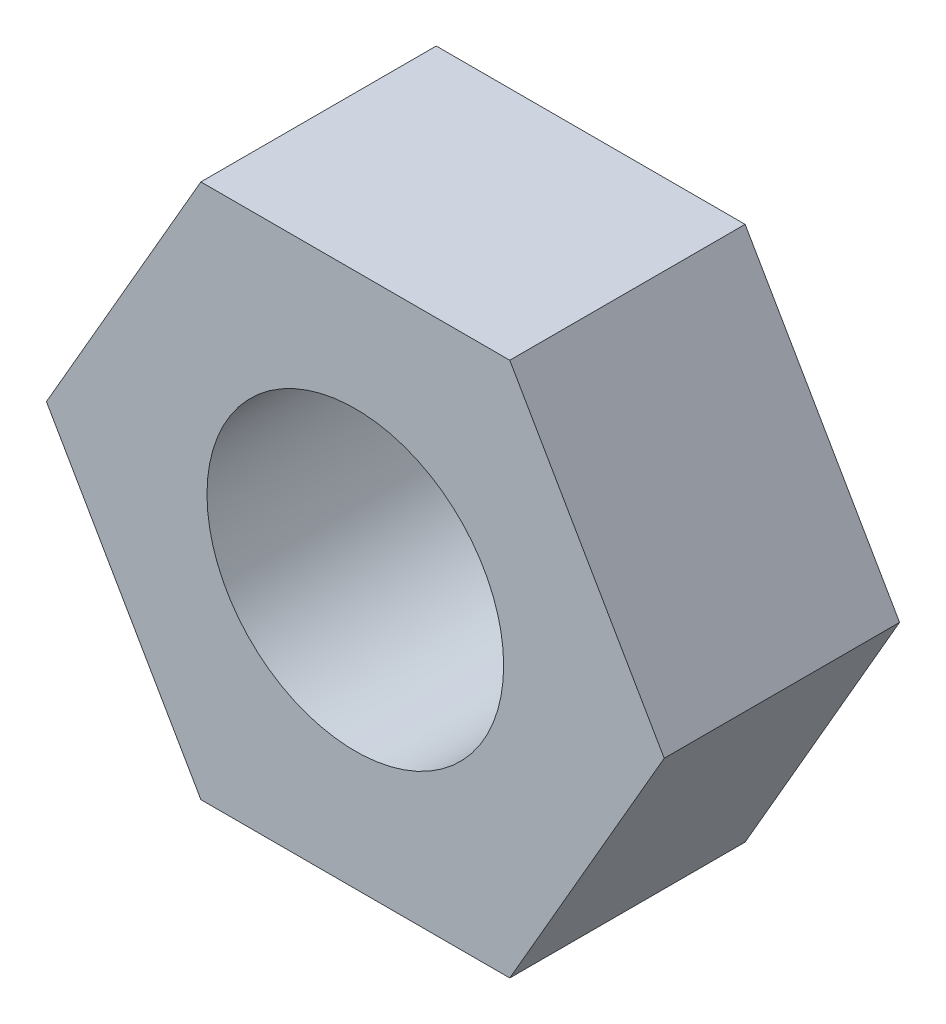
ISO-10303-21;
HEADER;
FILE_DESCRIPTION(('STEP AP214'),'2;1');
FILE_NAME('part.step','',(''),(''),'','','');
FILE_SCHEMA(('AUTOMOTIVE_DESIGN { 1 0 10303 214 1 1 1 1 }'));
ENDSEC;
DATA;
#1=APPLICATION_CONTEXT('core data for automotive mechanical design processes');
#2=APPLICATION_PROTOCOL_DEFINITION('international standard','automotive_design',2000,#1);
#3=PRODUCT_CONTEXT('',#1,'mechanical');
#4=PRODUCT('Part','Part','',(#3));
#5=PRODUCT_RELATED_PRODUCT_CATEGORY('part','',(#4));
#6=PRODUCT_DEFINITION_FORMATION('','',#4);
#7=PRODUCT_DEFINITION_CONTEXT('part definition',#1,'design');
#8=PRODUCT_DEFINITION('design','',#6,#7);
#9=PRODUCT_DEFINITION_SHAPE('','',#8);
#10=(LENGTH_UNIT() NAMED_UNIT(*) SI_UNIT(.MILLI.,.METRE.));
#11=(NAMED_UNIT(*) PLANE_ANGLE_UNIT() SI_UNIT($,.RADIAN.));
#12=(NAMED_UNIT(*) SI_UNIT($,.STERADIAN.) SOLID_ANGLE_UNIT());
#13=UNCERTAINTY_MEASURE_WITH_UNIT(LENGTH_MEASURE(1.E-05),#10,'distance_accuracy_value','');
#14=(GEOMETRIC_REPRESENTATION_CONTEXT(3) GLOBAL_UNCERTAINTY_ASSIGNED_CONTEXT((#13)) GLOBAL_UNIT_ASSIGNED_CONTEXT((#10,
#11,#12)) REPRESENTATION_CONTEXT('',''));
#15=CARTESIAN_POINT('',(0.,0.,0.));
#16=DIRECTION('',(0.,0.,1.));
#17=DIRECTION('',(1.,0.,0.));
#18=AXIS2_PLACEMENT_3D('',#15,#16,#17);
#19=CARTESIAN_POINT('',(0.,0.,2.38));
#20=DIRECTION('',(0.,0.,1.));
#21=DIRECTION('',(1.,0.,0.));
#22=AXIS2_PLACEMENT_3D('',#19,#20,#21);
#23=PLANE('',#22);
#24=DIRECTION('',(1.,0.,0.));
#25=VECTOR('',#24,1.);
#26=CARTESIAN_POINT('',(-1.56173247815794,-2.705,2.38));
#27=LINE('',#26,#25);
#28=CARTESIAN_POINT('',(-1.56173247815794,-2.705,2.38));
#29=VERTEX_POINT('',#28);
#30=CARTESIAN_POINT('',(1.56173247815794,-2.705,2.38));
#31=VERTEX_POINT('',#30);
#32=EDGE_CURVE('E152',#29,#31,#27,.T.);
#33=ORIENTED_EDGE('',*,*,#32,.T.);
#34=DIRECTION('',(0.5,0.866025403784439,0.));
#35=VECTOR('',#34,1.);
#36=CARTESIAN_POINT('',(1.56173247815794,-2.705,2.38));
#37=LINE('',#36,#35);
#38=CARTESIAN_POINT('',(3.12346495631587,0.,2.38));
#39=VERTEX_POINT('',#38);
#40=EDGE_CURVE('E100',#31,#39,#37,.T.);
#41=ORIENTED_EDGE('',*,*,#40,.T.);
#42=DIRECTION('',(-0.5,0.866025403784438,0.));
#43=VECTOR('',#42,1.);
#44=CARTESIAN_POINT('',(3.12346495631587,0.,2.38));
#45=LINE('',#44,#43);
#46=CARTESIAN_POINT('',(1.56173247815794,2.705,2.38));
#47=VERTEX_POINT('',#46);
#48=EDGE_CURVE('E113',#39,#47,#45,.T.);
#49=ORIENTED_EDGE('',*,*,#48,.T.);
#50=DIRECTION('',(-1.,0.,0.));
#51=VECTOR('',#50,1.);
#52=CARTESIAN_POINT('',(1.56173247815794,2.705,2.38));
#53=LINE('',#52,#51);
#54=CARTESIAN_POINT('',(-1.56173247815794,2.705,2.38));
#55=VERTEX_POINT('',#54);
#56=EDGE_CURVE('E107',#47,#55,#53,.T.);
#57=ORIENTED_EDGE('',*,*,#56,.T.);
#58=DIRECTION('',(-0.5,-0.866025403784439,0.));
#59=VECTOR('',#58,1.);
#60=CARTESIAN_POINT('',(-1.56173247815794,2.705,2.38));
#61=LINE('',#60,#59);
#62=CARTESIAN_POINT('',(-3.12346495631587,0.,2.38));
#63=VERTEX_POINT('',#62);
#64=EDGE_CURVE('E111',#55,#63,#61,.T.);
#65=ORIENTED_EDGE('',*,*,#64,.T.);
#66=DIRECTION('',(0.5,-0.866025403784438,0.));
#67=VECTOR('',#66,1.);
#68=CARTESIAN_POINT('',(-3.12346495631587,0.,2.38));
#69=LINE('',#68,#67);
#70=EDGE_CURVE('E63',#63,#29,#69,.T.);
#71=ORIENTED_EDGE('',*,*,#70,.T.);
#72=EDGE_LOOP('',(#33,#41,#49,#57,#65,#71));
#73=FACE_BOUND('',#72,.T.);
#74=CARTESIAN_POINT('',(0.,0.,2.38));
#75=DIRECTION('',(0.,0.,1.));
#76=DIRECTION('',(1.,0.,0.));
#77=AXIS2_PLACEMENT_3D('',#74,#75,#76);
#78=CIRCLE('',#77,1.5);
#79=CARTESIAN_POINT('',(1.5,0.,2.38));
#80=VERTEX_POINT('',#79);
#81=EDGE_CURVE('E140',#80,#80,#78,.T.);
#82=ORIENTED_EDGE('',*,*,#81,.F.);
#83=EDGE_LOOP('',(#82));
#84=FACE_BOUND('',#83,.T.);
#85=ADVANCED_FACE('F45',(#73,#84),#23,.T.);
#86=CARTESIAN_POINT('',(0.,0.,0.));
#87=DIRECTION('',(0.,0.,1.));
#88=DIRECTION('',(1.,0.,0.));
#89=AXIS2_PLACEMENT_3D('',#86,#87,#88);
#90=PLANE('',#89);
#91=DIRECTION('',(1.,0.,0.));
#92=VECTOR('',#91,1.);
#93=CARTESIAN_POINT('',(-1.56173247815794,-2.705,0.));
#94=LINE('',#93,#92);
#95=CARTESIAN_POINT('',(-1.56173247815794,-2.705,0.));
#96=VERTEX_POINT('',#95);
#97=CARTESIAN_POINT('',(1.56173247815794,-2.705,0.));
#98=VERTEX_POINT('',#97);
#99=EDGE_CURVE('E135',#96,#98,#94,.T.);
#100=ORIENTED_EDGE('',*,*,#99,.F.);
#101=DIRECTION('',(0.5,-0.866025403784438,0.));
#102=VECTOR('',#101,1.);
#103=CARTESIAN_POINT('',(-3.12346495631587,0.,0.));
#104=LINE('',#103,#102);
#105=CARTESIAN_POINT('',(-3.12346495631587,0.,0.));
#106=VERTEX_POINT('',#105);
#107=EDGE_CURVE('E92',#106,#96,#104,.T.);
#108=ORIENTED_EDGE('',*,*,#107,.F.);
#109=DIRECTION('',(-0.5,-0.866025403784439,0.));
#110=VECTOR('',#109,1.);
#111=CARTESIAN_POINT('',(-1.56173247815794,2.705,0.));
#112=LINE('',#111,#110);
#113=CARTESIAN_POINT('',(-1.56173247815794,2.705,0.));
#114=VERTEX_POINT('',#113);
#115=EDGE_CURVE('E86',#114,#106,#112,.T.);
#116=ORIENTED_EDGE('',*,*,#115,.F.);
#117=DIRECTION('',(-1.,0.,0.));
#118=VECTOR('',#117,1.);
#119=CARTESIAN_POINT('',(1.56173247815794,2.705,0.));
#120=LINE('',#119,#118);
#121=CARTESIAN_POINT('',(1.56173247815794,2.705,0.));
#122=VERTEX_POINT('',#121);
#123=EDGE_CURVE('E122',#122,#114,#120,.T.);
#124=ORIENTED_EDGE('',*,*,#123,.F.);
#125=DIRECTION('',(-0.5,0.866025403784438,0.));
#126=VECTOR('',#125,1.);
#127=CARTESIAN_POINT('',(3.12346495631587,0.,0.));
#128=LINE('',#127,#126);
#129=CARTESIAN_POINT('',(3.12346495631587,0.,0.));
#130=VERTEX_POINT('',#129);
#131=EDGE_CURVE('E143',#130,#122,#128,.T.);
#132=ORIENTED_EDGE('',*,*,#131,.F.);
#133=DIRECTION('',(0.5,0.866025403784439,0.));
#134=VECTOR('',#133,1.);
#135=CARTESIAN_POINT('',(1.56173247815794,-2.705,0.));
#136=LINE('',#135,#134);
#137=EDGE_CURVE('E139',#98,#130,#136,.T.);
#138=ORIENTED_EDGE('',*,*,#137,.F.);
#139=EDGE_LOOP('',(#100,#108,#116,#124,#132,#138));
#140=FACE_BOUND('',#139,.T.);
#141=CARTESIAN_POINT('',(0.,0.,0.));
#142=DIRECTION('',(0.,0.,1.));
#143=DIRECTION('',(1.,0.,0.));
#144=AXIS2_PLACEMENT_3D('',#141,#142,#143);
#145=CIRCLE('',#144,1.5);
#146=CARTESIAN_POINT('',(1.5,0.,0.));
#147=VERTEX_POINT('',#146);
#148=EDGE_CURVE('E249',#147,#147,#145,.T.);
#149=ORIENTED_EDGE('',*,*,#148,.T.);
#150=EDGE_LOOP('',(#149));
#151=FACE_BOUND('',#150,.T.);
#152=ADVANCED_FACE('F165',(#140,#151),#90,.F.);
#153=CARTESIAN_POINT('',(-1.56173247815794,-2.705,2.38));
#154=DIRECTION('',(0.,1.,0.));
#155=DIRECTION('',(-1.,0.,0.));
#156=AXIS2_PLACEMENT_3D('',#153,#154,#155);
#157=PLANE('',#156);
#158=ORIENTED_EDGE('',*,*,#99,.T.);
#159=DIRECTION('',(0.,0.,-1.));
#160=VECTOR('',#159,1.);
#161=CARTESIAN_POINT('',(1.56173247815794,-2.705,2.38));
#162=LINE('',#161,#160);
#163=EDGE_CURVE('E11',#31,#98,#162,.T.);
#164=ORIENTED_EDGE('',*,*,#163,.F.);
#165=ORIENTED_EDGE('',*,*,#32,.F.);
#166=DIRECTION('',(0.,0.,-1.));
#167=VECTOR('',#166,1.);
#168=CARTESIAN_POINT('',(-1.56173247815794,-2.705,2.38));
#169=LINE('',#168,#167);
#170=EDGE_CURVE('E131',#29,#96,#169,.T.);
#171=ORIENTED_EDGE('',*,*,#170,.T.);
#172=EDGE_LOOP('',(#158,#164,#165,#171));
#173=FACE_BOUND('',#172,.T.);
#174=ADVANCED_FACE('F47',(#173),#157,.F.);
#175=CARTESIAN_POINT('',(1.56173247815794,-2.705,2.38));
#176=DIRECTION('',(-0.866025403784439,0.5,0.));
#177=DIRECTION('',(-0.5,-0.866025403784439,0.));
#178=AXIS2_PLACEMENT_3D('',#175,#176,#177);
#179=PLANE('',#178);
#180=ORIENTED_EDGE('',*,*,#137,.T.);
#181=DIRECTION('',(0.,0.,-1.));
#182=VECTOR('',#181,1.);
#183=CARTESIAN_POINT('',(3.12346495631587,0.,2.38));
#184=LINE('',#183,#182);
#185=EDGE_CURVE('E55',#39,#130,#184,.T.);
#186=ORIENTED_EDGE('',*,*,#185,.F.);
#187=ORIENTED_EDGE('',*,*,#40,.F.);
#188=ORIENTED_EDGE('',*,*,#163,.T.);
#189=EDGE_LOOP('',(#180,#186,#187,#188));
#190=FACE_BOUND('',#189,.T.);
#191=ADVANCED_FACE('F190',(#190),#179,.F.);
#192=CARTESIAN_POINT('',(3.12346495631587,0.,2.38));
#193=DIRECTION('',(-0.866025403784438,-0.5,0.));
#194=DIRECTION('',(0.5,-0.866025403784439,0.));
#195=AXIS2_PLACEMENT_3D('',#192,#193,#194);
#196=PLANE('',#195);
#197=ORIENTED_EDGE('',*,*,#131,.T.);
#198=DIRECTION('',(0.,0.,-1.));
#199=VECTOR('',#198,1.);
#200=CARTESIAN_POINT('',(1.56173247815794,2.705,2.38));
#201=LINE('',#200,#199);
#202=EDGE_CURVE('E124',#47,#122,#201,.T.);
#203=ORIENTED_EDGE('',*,*,#202,.F.);
#204=ORIENTED_EDGE('',*,*,#48,.F.);
#205=ORIENTED_EDGE('',*,*,#185,.T.);
#206=EDGE_LOOP('',(#197,#203,#204,#205));
#207=FACE_BOUND('',#206,.T.);
#208=ADVANCED_FACE('F162',(#207),#196,.F.);
#209=CARTESIAN_POINT('',(1.56173247815794,2.705,2.38));
#210=DIRECTION('',(0.,-1.,0.));
#211=DIRECTION('',(0.,0.,-1.));
#212=AXIS2_PLACEMENT_3D('',#209,#210,#211);
#213=PLANE('',#212);
#214=ORIENTED_EDGE('',*,*,#123,.T.);
#215=DIRECTION('',(0.,0.,-1.));
#216=VECTOR('',#215,1.);
#217=CARTESIAN_POINT('',(-1.56173247815794,2.705,2.38));
#218=LINE('',#217,#216);
#219=EDGE_CURVE('E119',#55,#114,#218,.T.);
#220=ORIENTED_EDGE('',*,*,#219,.F.);
#221=ORIENTED_EDGE('',*,*,#56,.F.);
#222=ORIENTED_EDGE('',*,*,#202,.T.);
#223=EDGE_LOOP('',(#214,#220,#221,#222));
#224=FACE_BOUND('',#223,.T.);
#225=ADVANCED_FACE('F120',(#224),#213,.F.);
#226=CARTESIAN_POINT('',(-1.56173247815794,2.705,2.38));
#227=DIRECTION('',(0.866025403784439,-0.5,0.));
#228=DIRECTION('',(0.5,0.866025403784439,0.));
#229=AXIS2_PLACEMENT_3D('',#226,#227,#228);
#230=PLANE('',#229);
#231=ORIENTED_EDGE('',*,*,#115,.T.);
#232=DIRECTION('',(0.,0.,-1.));
#233=VECTOR('',#232,1.);
#234=CARTESIAN_POINT('',(-3.12346495631587,0.,2.38));
#235=LINE('',#234,#233);
#236=EDGE_CURVE('E125',#63,#106,#235,.T.);
#237=ORIENTED_EDGE('',*,*,#236,.F.);
#238=ORIENTED_EDGE('',*,*,#64,.F.);
#239=ORIENTED_EDGE('',*,*,#219,.T.);
#240=EDGE_LOOP('',(#231,#237,#238,#239));
#241=FACE_BOUND('',#240,.T.);
#242=ADVANCED_FACE('F127',(#241),#230,.F.);
#243=CARTESIAN_POINT('',(-3.12346495631587,0.,2.38));
#244=DIRECTION('',(0.866025403784438,0.5,0.));
#245=DIRECTION('',(-0.5,0.866025403784439,0.));
#246=AXIS2_PLACEMENT_3D('',#243,#244,#245);
#247=PLANE('',#246);
#248=ORIENTED_EDGE('',*,*,#107,.T.);
#249=ORIENTED_EDGE('',*,*,#170,.F.);
#250=ORIENTED_EDGE('',*,*,#70,.F.);
#251=ORIENTED_EDGE('',*,*,#236,.T.);
#252=EDGE_LOOP('',(#248,#249,#250,#251));
#253=FACE_BOUND('',#252,.T.);
#254=ADVANCED_FACE('F170',(#253),#247,.F.);
#255=CARTESIAN_POINT('',(0.,0.,2.38));
#256=DIRECTION('',(0.,0.,-1.));
#257=DIRECTION('',(-1.,0.,0.));
#258=AXIS2_PLACEMENT_3D('',#255,#256,#257);
#259=CYLINDRICAL_SURFACE('',#258,1.5);
#260=ORIENTED_EDGE('',*,*,#81,.T.);
#261=EDGE_LOOP('',(#260));
#262=FACE_BOUND('',#261,.T.);
#263=ORIENTED_EDGE('',*,*,#148,.F.);
#264=EDGE_LOOP('',(#263));
#265=FACE_BOUND('',#264,.T.);
#266=ADVANCED_FACE('F172',(#262,#265),#259,.F.);
#267=CLOSED_SHELL('',(#85,#152,#174,#191,#208,#225,#242,#254,#266));
#268=MANIFOLD_SOLID_BREP('B2',#267);
#269=ADVANCED_BREP_SHAPE_REPRESENTATION('',(#18,#268),#14);
#270=SHAPE_DEFINITION_REPRESENTATION(#9,#269);
ENDSEC;
END-ISO-10303-21;
